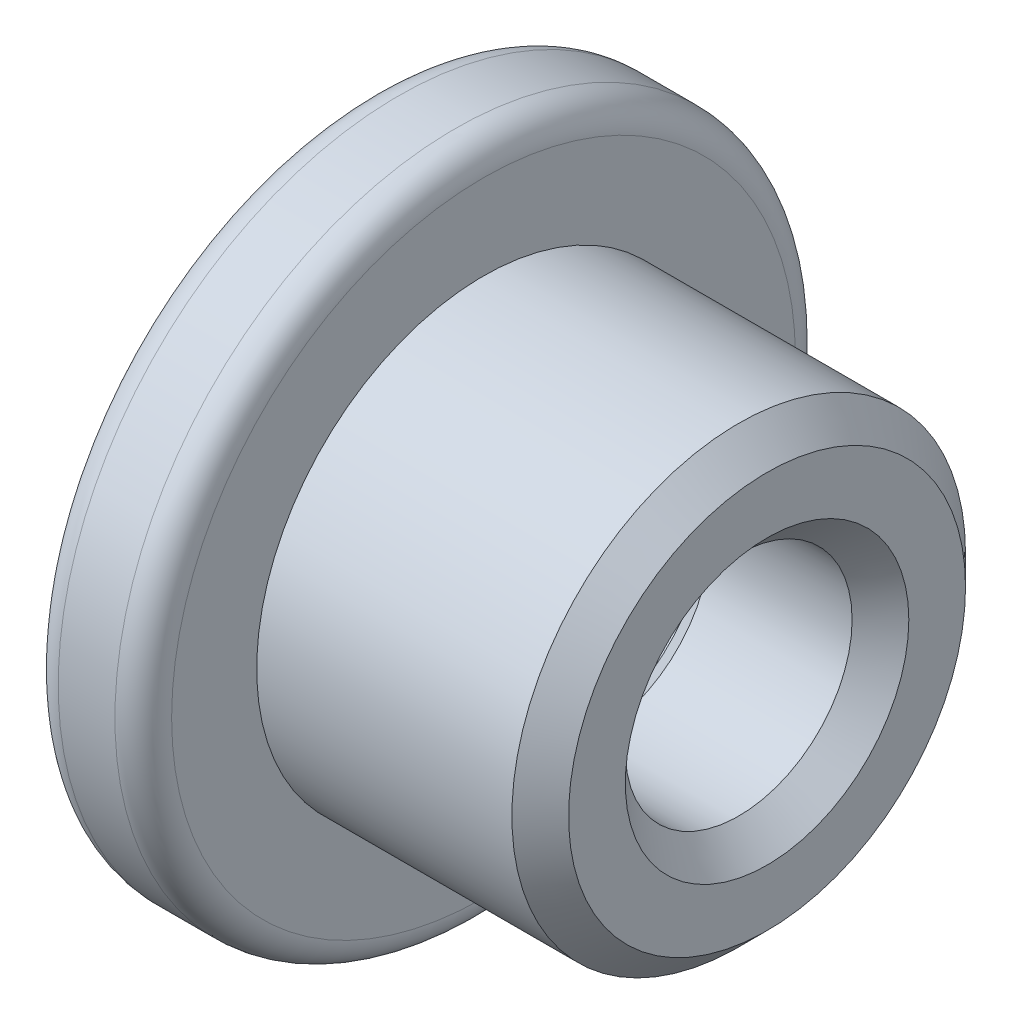
ISO-10303-21;
HEADER;
FILE_DESCRIPTION(('STEP AP214'),'2;1');
FILE_NAME('part.step','',(''),(''),'','','');
FILE_SCHEMA(('AUTOMOTIVE_DESIGN { 1 0 10303 214 1 1 1 1 }'));
ENDSEC;
DATA;
#1=APPLICATION_CONTEXT('core data for automotive mechanical design processes');
#2=APPLICATION_PROTOCOL_DEFINITION('international standard','automotive_design',2000,#1);
#3=PRODUCT_CONTEXT('',#1,'mechanical');
#4=PRODUCT('Part','Part','',(#3));
#5=PRODUCT_RELATED_PRODUCT_CATEGORY('part','',(#4));
#6=PRODUCT_DEFINITION_FORMATION('','',#4);
#7=PRODUCT_DEFINITION_CONTEXT('part definition',#1,'design');
#8=PRODUCT_DEFINITION('design','',#6,#7);
#9=PRODUCT_DEFINITION_SHAPE('','',#8);
#10=(LENGTH_UNIT() NAMED_UNIT(*) SI_UNIT(.MILLI.,.METRE.));
#11=(NAMED_UNIT(*) PLANE_ANGLE_UNIT() SI_UNIT($,.RADIAN.));
#12=(NAMED_UNIT(*) SI_UNIT($,.STERADIAN.) SOLID_ANGLE_UNIT());
#13=UNCERTAINTY_MEASURE_WITH_UNIT(LENGTH_MEASURE(1.E-05),#10,'distance_accuracy_value','');
#14=(GEOMETRIC_REPRESENTATION_CONTEXT(3) GLOBAL_UNCERTAINTY_ASSIGNED_CONTEXT((#13)) GLOBAL_UNIT_ASSIGNED_CONTEXT((#10,
#11,#12)) REPRESENTATION_CONTEXT('',''));
#15=CARTESIAN_POINT('',(0.,0.,0.));
#16=DIRECTION('',(0.,0.,1.));
#17=DIRECTION('',(1.,0.,0.));
#18=AXIS2_PLACEMENT_3D('',#15,#16,#17);
#19=CARTESIAN_POINT('',(1.5,0.,5.));
#20=DIRECTION('',(1.,0.,0.));
#21=DIRECTION('',(0.,0.,-1.));
#22=AXIS2_PLACEMENT_3D('',#19,#20,#21);
#23=PLANE('',#22);
#24=DIRECTION('',(0.,-1.,0.));
#25=VECTOR('',#24,1.);
#26=CARTESIAN_POINT('',(1.5,1.44337567297407,-2.5));
#27=LINE('',#26,#25);
#28=CARTESIAN_POINT('',(1.5,1.44337567297407,-2.5));
#29=VERTEX_POINT('',#28);
#30=CARTESIAN_POINT('',(1.5,0.,-2.5));
#31=VERTEX_POINT('',#30);
#32=EDGE_CURVE('E110',#29,#31,#27,.T.);
#33=ORIENTED_EDGE('',*,*,#32,.T.);
#34=CARTESIAN_POINT('',(1.5,0.,0.));
#35=DIRECTION('',(1.,0.,0.));
#36=DIRECTION('',(0.,0.,-1.));
#37=AXIS2_PLACEMENT_3D('',#34,#35,#36);
#38=CIRCLE('',#37,2.5);
#39=CARTESIAN_POINT('',(1.5,2.1650635094611,-1.25));
#40=VERTEX_POINT('',#39);
#41=EDGE_CURVE('E191',#31,#40,#38,.T.);
#42=ORIENTED_EDGE('',*,*,#41,.T.);
#43=DIRECTION('',(0.,-0.5,-0.866025403784439));
#44=VECTOR('',#43,1.);
#45=CARTESIAN_POINT('',(1.5,2.88675134594813,0.));
#46=LINE('',#45,#44);
#47=EDGE_CURVE('E143',#40,#29,#46,.T.);
#48=ORIENTED_EDGE('',*,*,#47,.T.);
#49=EDGE_LOOP('',(#33,#42,#48));
#50=FACE_BOUND('',#49,.T.);
#51=ADVANCED_FACE('F27',(#50),#23,.F.);
#52=CARTESIAN_POINT('',(1.5,2.88675134594813,0.));
#53=VERTEX_POINT('',#52);
#54=EDGE_CURVE('E144',#53,#40,#46,.T.);
#55=ORIENTED_EDGE('',*,*,#54,.T.);
#56=CARTESIAN_POINT('',(1.5,0.,0.));
#57=DIRECTION('',(1.,0.,0.));
#58=DIRECTION('',(0.,0.,-1.));
#59=AXIS2_PLACEMENT_3D('',#56,#57,#58);
#60=CIRCLE('',#59,2.5);
#61=CARTESIAN_POINT('',(1.5,2.1650635094611,1.25));
#62=VERTEX_POINT('',#61);
#63=EDGE_CURVE('E189',#40,#62,#60,.T.);
#64=ORIENTED_EDGE('',*,*,#63,.T.);
#65=DIRECTION('',(0.,0.5,-0.866025403784439));
#66=VECTOR('',#65,1.);
#67=CARTESIAN_POINT('',(1.5,1.44337567297406,2.5));
#68=LINE('',#67,#66);
#69=EDGE_CURVE('E140',#62,#53,#68,.T.);
#70=ORIENTED_EDGE('',*,*,#69,.T.);
#71=EDGE_LOOP('',(#55,#64,#70));
#72=FACE_BOUND('',#71,.T.);
#73=ADVANCED_FACE('F229',(#72),#23,.F.);
#74=CARTESIAN_POINT('',(1.5,1.44337567297406,2.5));
#75=VERTEX_POINT('',#74);
#76=EDGE_CURVE('E141',#75,#62,#68,.T.);
#77=ORIENTED_EDGE('',*,*,#76,.T.);
#78=CARTESIAN_POINT('',(1.5,0.,0.));
#79=DIRECTION('',(1.,0.,0.));
#80=DIRECTION('',(0.,0.,-1.));
#81=AXIS2_PLACEMENT_3D('',#78,#79,#80);
#82=CIRCLE('',#81,2.5);
#83=CARTESIAN_POINT('',(1.5,0.,2.5));
#84=VERTEX_POINT('',#83);
#85=EDGE_CURVE('E42',#62,#84,#82,.T.);
#86=ORIENTED_EDGE('',*,*,#85,.T.);
#87=DIRECTION('',(0.,1.,0.));
#88=VECTOR('',#87,1.);
#89=CARTESIAN_POINT('',(1.5,-1.44337567297407,2.5));
#90=LINE('',#89,#88);
#91=EDGE_CURVE('E157',#84,#75,#90,.T.);
#92=ORIENTED_EDGE('',*,*,#91,.T.);
#93=EDGE_LOOP('',(#77,#86,#92));
#94=FACE_BOUND('',#93,.T.);
#95=ADVANCED_FACE('F236',(#94),#23,.F.);
#96=CARTESIAN_POINT('',(1.5,-1.44337567297407,2.5));
#97=VERTEX_POINT('',#96);
#98=EDGE_CURVE('E158',#97,#84,#90,.T.);
#99=ORIENTED_EDGE('',*,*,#98,.T.);
#100=CARTESIAN_POINT('',(1.5,0.,0.));
#101=DIRECTION('',(1.,0.,0.));
#102=DIRECTION('',(0.,0.,-1.));
#103=AXIS2_PLACEMENT_3D('',#100,#101,#102);
#104=CIRCLE('',#103,2.5);
#105=CARTESIAN_POINT('',(1.5,-2.1650635094611,1.25));
#106=VERTEX_POINT('',#105);
#107=EDGE_CURVE('E50',#84,#106,#104,.T.);
#108=ORIENTED_EDGE('',*,*,#107,.T.);
#109=DIRECTION('',(0.,0.5,0.866025403784439));
#110=VECTOR('',#109,1.);
#111=CARTESIAN_POINT('',(1.5,-2.88675134594813,0.));
#112=LINE('',#111,#110);
#113=EDGE_CURVE('E153',#106,#97,#112,.T.);
#114=ORIENTED_EDGE('',*,*,#113,.T.);
#115=EDGE_LOOP('',(#99,#108,#114));
#116=FACE_BOUND('',#115,.T.);
#117=ADVANCED_FACE('F253',(#116),#23,.F.);
#118=CARTESIAN_POINT('',(1.5,-2.88675134594813,0.));
#119=VERTEX_POINT('',#118);
#120=EDGE_CURVE('E154',#119,#106,#112,.T.);
#121=ORIENTED_EDGE('',*,*,#120,.T.);
#122=CARTESIAN_POINT('',(1.5,0.,0.));
#123=DIRECTION('',(1.,0.,0.));
#124=DIRECTION('',(0.,0.,-1.));
#125=AXIS2_PLACEMENT_3D('',#122,#123,#124);
#126=CIRCLE('',#125,2.5);
#127=CARTESIAN_POINT('',(1.5,-2.1650635094611,-1.25));
#128=VERTEX_POINT('',#127);
#129=EDGE_CURVE('E185',#106,#128,#126,.T.);
#130=ORIENTED_EDGE('',*,*,#129,.T.);
#131=DIRECTION('',(0.,-0.5,0.866025403784439));
#132=VECTOR('',#131,1.);
#133=CARTESIAN_POINT('',(1.5,-1.44337567297406,-2.5));
#134=LINE('',#133,#132);
#135=EDGE_CURVE('E149',#128,#119,#134,.T.);
#136=ORIENTED_EDGE('',*,*,#135,.T.);
#137=EDGE_LOOP('',(#121,#130,#136));
#138=FACE_BOUND('',#137,.T.);
#139=ADVANCED_FACE('F243',(#138),#23,.F.);
#140=CARTESIAN_POINT('',(5.,0.,0.));
#141=DIRECTION('',(1.,0.,0.));
#142=DIRECTION('',(0.,0.,-1.));
#143=AXIS2_PLACEMENT_3D('',#140,#141,#142);
#144=PLANE('',#143);
#145=CARTESIAN_POINT('',(5.,0.,0.));
#146=DIRECTION('',(1.,0.,0.));
#147=DIRECTION('',(0.,0.,-1.));
#148=AXIS2_PLACEMENT_3D('',#145,#146,#147);
#149=CIRCLE('',#148,2.5);
#150=CARTESIAN_POINT('',(5.,0.,-2.5));
#151=VERTEX_POINT('',#150);
#152=EDGE_CURVE('E180',#151,#151,#149,.F.);
#153=ORIENTED_EDGE('',*,*,#152,.T.);
#154=EDGE_LOOP('',(#153));
#155=FACE_BOUND('',#154,.T.);
#156=CARTESIAN_POINT('',(5.,0.,0.));
#157=DIRECTION('',(1.,0.,0.));
#158=DIRECTION('',(0.,0.,-1.));
#159=AXIS2_PLACEMENT_3D('',#156,#157,#158);
#160=CIRCLE('',#159,3.5);
#161=CARTESIAN_POINT('',(5.,0.,-3.5));
#162=VERTEX_POINT('',#161);
#163=EDGE_CURVE('E177',#162,#162,#160,.T.);
#164=ORIENTED_EDGE('',*,*,#163,.T.);
#165=EDGE_LOOP('',(#164));
#166=FACE_BOUND('',#165,.T.);
#167=ADVANCED_FACE('F252',(#155,#166),#144,.T.);
#168=CARTESIAN_POINT('',(5.,0.,0.));
#169=DIRECTION('',(-1.,0.,0.));
#170=DIRECTION('',(0.,0.,1.));
#171=AXIS2_PLACEMENT_3D('',#168,#169,#170);
#172=CYLINDRICAL_SURFACE('',#171,4.);
#173=CARTESIAN_POINT('',(4.5,0.,0.));
#174=DIRECTION('',(1.,0.,0.));
#175=DIRECTION('',(0.,0.,-1.));
#176=AXIS2_PLACEMENT_3D('',#173,#174,#175);
#177=CIRCLE('',#176,4.);
#178=CARTESIAN_POINT('',(4.5,0.,-4.));
#179=VERTEX_POINT('',#178);
#180=EDGE_CURVE('E194',#179,#179,#177,.F.);
#181=ORIENTED_EDGE('',*,*,#180,.T.);
#182=EDGE_LOOP('',(#181));
#183=FACE_BOUND('',#182,.T.);
#184=CARTESIAN_POINT('',(0.,0.,0.));
#185=DIRECTION('',(1.,0.,0.));
#186=DIRECTION('',(0.,0.,-1.));
#187=AXIS2_PLACEMENT_3D('',#184,#185,#186);
#188=CIRCLE('',#187,4.);
#189=CARTESIAN_POINT('',(0.,0.,-4.));
#190=VERTEX_POINT('',#189);
#191=EDGE_CURVE('E162',#190,#190,#188,.T.);
#192=ORIENTED_EDGE('',*,*,#191,.T.);
#193=EDGE_LOOP('',(#192));
#194=FACE_BOUND('',#193,.T.);
#195=ADVANCED_FACE('F29',(#183,#194),#172,.T.);
#196=CARTESIAN_POINT('',(5.,0.,0.));
#197=DIRECTION('',(-1.,0.,0.));
#198=DIRECTION('',(0.,0.,1.));
#199=AXIS2_PLACEMENT_3D('',#196,#197,#198);
#200=CYLINDRICAL_SURFACE('',#199,2.);
#201=CARTESIAN_POINT('',(4.5,0.,0.));
#202=DIRECTION('',(1.,0.,0.));
#203=DIRECTION('',(0.,0.,-1.));
#204=AXIS2_PLACEMENT_3D('',#201,#202,#203);
#205=CIRCLE('',#204,2.);
#206=CARTESIAN_POINT('',(4.5,0.,-2.));
#207=VERTEX_POINT('',#206);
#208=EDGE_CURVE('E174',#207,#207,#205,.T.);
#209=ORIENTED_EDGE('',*,*,#208,.T.);
#210=EDGE_LOOP('',(#209));
#211=FACE_BOUND('',#210,.T.);
#212=CARTESIAN_POINT('',(2.,0.,0.));
#213=DIRECTION('',(1.,0.,0.));
#214=DIRECTION('',(0.,0.,-1.));
#215=AXIS2_PLACEMENT_3D('',#212,#213,#214);
#216=CIRCLE('',#215,2.);
#217=CARTESIAN_POINT('',(2.,0.,-2.));
#218=VERTEX_POINT('',#217);
#219=EDGE_CURVE('E171',#218,#218,#216,.F.);
#220=ORIENTED_EDGE('',*,*,#219,.T.);
#221=EDGE_LOOP('',(#220));
#222=FACE_BOUND('',#221,.T.);
#223=ADVANCED_FACE('F217',(#211,#222),#200,.F.);
#224=CARTESIAN_POINT('',(-2.,0.,0.));
#225=DIRECTION('',(1.,0.,0.));
#226=DIRECTION('',(0.,0.,-1.));
#227=AXIS2_PLACEMENT_3D('',#224,#225,#226);
#228=PLANE('',#227);
#229=CARTESIAN_POINT('',(-2.,0.,0.));
#230=DIRECTION('',(1.,0.,0.));
#231=DIRECTION('',(0.,0.,-1.));
#232=AXIS2_PLACEMENT_3D('',#229,#230,#231);
#233=CIRCLE('',#232,5.5);
#234=CARTESIAN_POINT('',(-2.,0.,-5.5));
#235=VERTEX_POINT('',#234);
#236=EDGE_CURVE('E197',#235,#235,#233,.F.);
#237=ORIENTED_EDGE('',*,*,#236,.T.);
#238=EDGE_LOOP('',(#237));
#239=FACE_BOUND('',#238,.T.);
#240=DIRECTION('',(0.,-0.5,-0.866025403784439));
#241=VECTOR('',#240,1.);
#242=CARTESIAN_POINT('',(-2.,2.88675134594813,0.));
#243=LINE('',#242,#241);
#244=CARTESIAN_POINT('',(-2.,2.88675134594813,0.));
#245=VERTEX_POINT('',#244);
#246=CARTESIAN_POINT('',(-2.,1.44337567297407,-2.5));
#247=VERTEX_POINT('',#246);
#248=EDGE_CURVE('E118',#245,#247,#243,.T.);
#249=ORIENTED_EDGE('',*,*,#248,.F.);
#250=DIRECTION('',(0.,0.5,-0.866025403784439));
#251=VECTOR('',#250,1.);
#252=CARTESIAN_POINT('',(-2.,1.44337567297406,2.5));
#253=LINE('',#252,#251);
#254=CARTESIAN_POINT('',(-2.,1.44337567297406,2.5));
#255=VERTEX_POINT('',#254);
#256=EDGE_CURVE('E124',#255,#245,#253,.T.);
#257=ORIENTED_EDGE('',*,*,#256,.F.);
#258=DIRECTION('',(0.,1.,0.));
#259=VECTOR('',#258,1.);
#260=CARTESIAN_POINT('',(-2.,-1.44337567297407,2.5));
#261=LINE('',#260,#259);
#262=CARTESIAN_POINT('',(-2.,-1.44337567297407,2.5));
#263=VERTEX_POINT('',#262);
#264=EDGE_CURVE('E137',#263,#255,#261,.T.);
#265=ORIENTED_EDGE('',*,*,#264,.F.);
#266=DIRECTION('',(0.,0.5,0.866025403784439));
#267=VECTOR('',#266,1.);
#268=CARTESIAN_POINT('',(-2.,-2.88675134594813,0.));
#269=LINE('',#268,#267);
#270=CARTESIAN_POINT('',(-2.,-2.88675134594813,0.));
#271=VERTEX_POINT('',#270);
#272=EDGE_CURVE('E131',#271,#263,#269,.T.);
#273=ORIENTED_EDGE('',*,*,#272,.F.);
#274=DIRECTION('',(0.,-0.5,0.866025403784439));
#275=VECTOR('',#274,1.);
#276=CARTESIAN_POINT('',(-2.,-1.44337567297406,-2.5));
#277=LINE('',#276,#275);
#278=CARTESIAN_POINT('',(-2.,-1.44337567297406,-2.5));
#279=VERTEX_POINT('',#278);
#280=EDGE_CURVE('E129',#279,#271,#277,.T.);
#281=ORIENTED_EDGE('',*,*,#280,.F.);
#282=DIRECTION('',(0.,-1.,0.));
#283=VECTOR('',#282,1.);
#284=CARTESIAN_POINT('',(-2.,1.44337567297407,-2.5));
#285=LINE('',#284,#283);
#286=EDGE_CURVE('E106',#247,#279,#285,.T.);
#287=ORIENTED_EDGE('',*,*,#286,.F.);
#288=EDGE_LOOP('',(#249,#257,#265,#273,#281,#287));
#289=FACE_BOUND('',#288,.T.);
#290=ADVANCED_FACE('F126',(#239,#289),#228,.F.);
#291=CARTESIAN_POINT('',(-18.9705627484771,0.,0.));
#292=DIRECTION('',(1.,0.,0.));
#293=DIRECTION('',(0.,0.,-1.));
#294=AXIS2_PLACEMENT_3D('',#291,#292,#293);
#295=CYLINDRICAL_SURFACE('',#294,6.);
#296=CARTESIAN_POINT('',(-1.5,0.,0.));
#297=DIRECTION('',(1.,0.,0.));
#298=DIRECTION('',(0.,0.,-1.));
#299=AXIS2_PLACEMENT_3D('',#296,#297,#298);
#300=CIRCLE('',#299,6.);
#301=CARTESIAN_POINT('',(-1.5,0.,-6.));
#302=VERTEX_POINT('',#301);
#303=EDGE_CURVE('E35',#302,#302,#300,.T.);
#304=ORIENTED_EDGE('',*,*,#303,.T.);
#305=EDGE_LOOP('',(#304));
#306=FACE_BOUND('',#305,.T.);
#307=CARTESIAN_POINT('',(-0.5,0.,0.));
#308=DIRECTION('',(1.,0.,0.));
#309=DIRECTION('',(0.,0.,-1.));
#310=AXIS2_PLACEMENT_3D('',#307,#308,#309);
#311=CIRCLE('',#310,6.);
#312=CARTESIAN_POINT('',(-0.5,0.,-6.));
#313=VERTEX_POINT('',#312);
#314=EDGE_CURVE('E200',#313,#313,#311,.F.);
#315=ORIENTED_EDGE('',*,*,#314,.T.);
#316=EDGE_LOOP('',(#315));
#317=FACE_BOUND('',#316,.T.);
#318=ADVANCED_FACE('F205',(#306,#317),#295,.T.);
#319=CARTESIAN_POINT('',(0.,0.,0.));
#320=DIRECTION('',(1.,0.,0.));
#321=DIRECTION('',(0.,0.,-1.));
#322=AXIS2_PLACEMENT_3D('',#319,#320,#321);
#323=PLANE('',#322);
#324=CARTESIAN_POINT('',(0.,0.,0.));
#325=DIRECTION('',(1.,0.,0.));
#326=DIRECTION('',(0.,0.,-1.));
#327=AXIS2_PLACEMENT_3D('',#324,#325,#326);
#328=CIRCLE('',#327,5.5);
#329=CARTESIAN_POINT('',(0.,0.,-5.5));
#330=VERTEX_POINT('',#329);
#331=EDGE_CURVE('E11',#330,#330,#328,.T.);
#332=ORIENTED_EDGE('',*,*,#331,.T.);
#333=EDGE_LOOP('',(#332));
#334=FACE_BOUND('',#333,.T.);
#335=ORIENTED_EDGE('',*,*,#191,.F.);
#336=EDGE_LOOP('',(#335));
#337=FACE_BOUND('',#336,.T.);
#338=ADVANCED_FACE('F223',(#334,#337),#323,.T.);
#339=CARTESIAN_POINT('',(1.5,1.44337567297406,2.5));
#340=DIRECTION('',(0.,0.866025403784439,0.5));
#341=DIRECTION('',(0.,-0.5,0.866025403784439));
#342=AXIS2_PLACEMENT_3D('',#339,#340,#341);
#343=PLANE('',#342);
#344=ORIENTED_EDGE('',*,*,#256,.T.);
#345=DIRECTION('',(-1.,0.,0.));
#346=VECTOR('',#345,1.);
#347=CARTESIAN_POINT('',(1.5,2.88675134594813,0.));
#348=LINE('',#347,#346);
#349=EDGE_CURVE('E114',#53,#245,#348,.T.);
#350=ORIENTED_EDGE('',*,*,#349,.F.);
#351=ORIENTED_EDGE('',*,*,#69,.F.);
#352=ORIENTED_EDGE('',*,*,#76,.F.);
#353=DIRECTION('',(-1.,0.,0.));
#354=VECTOR('',#353,1.);
#355=CARTESIAN_POINT('',(1.5,1.44337567297406,2.5));
#356=LINE('',#355,#354);
#357=EDGE_CURVE('E160',#75,#255,#356,.T.);
#358=ORIENTED_EDGE('',*,*,#357,.T.);
#359=EDGE_LOOP('',(#344,#350,#351,#352,#358));
#360=FACE_BOUND('',#359,.T.);
#361=ADVANCED_FACE('F272',(#360),#343,.F.);
#362=CARTESIAN_POINT('',(1.5,-1.44337567297407,2.5));
#363=DIRECTION('',(0.,0.,1.));
#364=DIRECTION('',(1.,0.,0.));
#365=AXIS2_PLACEMENT_3D('',#362,#363,#364);
#366=PLANE('',#365);
#367=ORIENTED_EDGE('',*,*,#264,.T.);
#368=ORIENTED_EDGE('',*,*,#357,.F.);
#369=ORIENTED_EDGE('',*,*,#91,.F.);
#370=ORIENTED_EDGE('',*,*,#98,.F.);
#371=DIRECTION('',(-1.,0.,0.));
#372=VECTOR('',#371,1.);
#373=CARTESIAN_POINT('',(1.5,-1.44337567297407,2.5));
#374=LINE('',#373,#372);
#375=EDGE_CURVE('E163',#97,#263,#374,.T.);
#376=ORIENTED_EDGE('',*,*,#375,.T.);
#377=EDGE_LOOP('',(#367,#368,#369,#370,#376));
#378=FACE_BOUND('',#377,.T.);
#379=ADVANCED_FACE('F276',(#378),#366,.F.);
#380=CARTESIAN_POINT('',(1.5,-2.88675134594813,0.));
#381=DIRECTION('',(0.,-0.866025403784439,0.5));
#382=DIRECTION('',(0.,-0.5,-0.866025403784439));
#383=AXIS2_PLACEMENT_3D('',#380,#381,#382);
#384=PLANE('',#383);
#385=ORIENTED_EDGE('',*,*,#272,.T.);
#386=ORIENTED_EDGE('',*,*,#375,.F.);
#387=ORIENTED_EDGE('',*,*,#113,.F.);
#388=ORIENTED_EDGE('',*,*,#120,.F.);
#389=DIRECTION('',(-1.,0.,0.));
#390=VECTOR('',#389,1.);
#391=CARTESIAN_POINT('',(1.5,-2.88675134594813,0.));
#392=LINE('',#391,#390);
#393=EDGE_CURVE('E165',#119,#271,#392,.T.);
#394=ORIENTED_EDGE('',*,*,#393,.T.);
#395=EDGE_LOOP('',(#385,#386,#387,#388,#394));
#396=FACE_BOUND('',#395,.T.);
#397=ADVANCED_FACE('F279',(#396),#384,.F.);
#398=CARTESIAN_POINT('',(1.5,-1.44337567297406,-2.5));
#399=DIRECTION('',(0.,-0.866025403784439,-0.5));
#400=DIRECTION('',(0.,0.5,-0.866025403784439));
#401=AXIS2_PLACEMENT_3D('',#398,#399,#400);
#402=PLANE('',#401);
#403=ORIENTED_EDGE('',*,*,#280,.T.);
#404=ORIENTED_EDGE('',*,*,#393,.F.);
#405=ORIENTED_EDGE('',*,*,#135,.F.);
#406=CARTESIAN_POINT('',(1.5,-1.44337567297406,-2.5));
#407=VERTEX_POINT('',#406);
#408=EDGE_CURVE('E150',#407,#128,#134,.T.);
#409=ORIENTED_EDGE('',*,*,#408,.F.);
#410=DIRECTION('',(-1.,0.,0.));
#411=VECTOR('',#410,1.);
#412=CARTESIAN_POINT('',(1.5,-1.44337567297406,-2.5));
#413=LINE('',#412,#411);
#414=EDGE_CURVE('E113',#407,#279,#413,.T.);
#415=ORIENTED_EDGE('',*,*,#414,.T.);
#416=EDGE_LOOP('',(#403,#404,#405,#409,#415));
#417=FACE_BOUND('',#416,.T.);
#418=ADVANCED_FACE('F281',(#417),#402,.F.);
#419=CARTESIAN_POINT('',(1.5,1.44337567297407,-2.5));
#420=DIRECTION('',(0.,0.,-1.));
#421=DIRECTION('',(0.,1.,0.));
#422=AXIS2_PLACEMENT_3D('',#419,#420,#421);
#423=PLANE('',#422);
#424=ORIENTED_EDGE('',*,*,#286,.T.);
#425=ORIENTED_EDGE('',*,*,#414,.F.);
#426=EDGE_CURVE('E147',#31,#407,#27,.T.);
#427=ORIENTED_EDGE('',*,*,#426,.F.);
#428=ORIENTED_EDGE('',*,*,#32,.F.);
#429=DIRECTION('',(-1.,0.,0.));
#430=VECTOR('',#429,1.);
#431=CARTESIAN_POINT('',(1.5,1.44337567297407,-2.5));
#432=LINE('',#431,#430);
#433=EDGE_CURVE('E101',#29,#247,#432,.T.);
#434=ORIENTED_EDGE('',*,*,#433,.T.);
#435=EDGE_LOOP('',(#424,#425,#427,#428,#434));
#436=FACE_BOUND('',#435,.T.);
#437=ADVANCED_FACE('F103',(#436),#423,.F.);
#438=CARTESIAN_POINT('',(1.5,2.88675134594813,0.));
#439=DIRECTION('',(0.,0.866025403784439,-0.5));
#440=DIRECTION('',(0.,0.5,0.866025403784439));
#441=AXIS2_PLACEMENT_3D('',#438,#439,#440);
#442=PLANE('',#441);
#443=ORIENTED_EDGE('',*,*,#248,.T.);
#444=ORIENTED_EDGE('',*,*,#433,.F.);
#445=ORIENTED_EDGE('',*,*,#47,.F.);
#446=ORIENTED_EDGE('',*,*,#54,.F.);
#447=ORIENTED_EDGE('',*,*,#349,.T.);
#448=EDGE_LOOP('',(#443,#444,#445,#446,#447));
#449=FACE_BOUND('',#448,.T.);
#450=ADVANCED_FACE('F119',(#449),#442,.F.);
#451=ORIENTED_EDGE('',*,*,#408,.T.);
#452=CARTESIAN_POINT('',(1.5,0.,0.));
#453=DIRECTION('',(1.,0.,0.));
#454=DIRECTION('',(0.,0.,-1.));
#455=AXIS2_PLACEMENT_3D('',#452,#453,#454);
#456=CIRCLE('',#455,2.5);
#457=EDGE_CURVE('E183',#128,#31,#456,.T.);
#458=ORIENTED_EDGE('',*,*,#457,.T.);
#459=ORIENTED_EDGE('',*,*,#426,.T.);
#460=EDGE_LOOP('',(#451,#458,#459));
#461=FACE_BOUND('',#460,.T.);
#462=ADVANCED_FACE('F232',(#461),#23,.F.);
#463=CARTESIAN_POINT('',(4.5,0.,0.));
#464=DIRECTION('',(1.,0.,0.));
#465=DIRECTION('',(0.,0.,-1.));
#466=AXIS2_PLACEMENT_3D('',#463,#464,#465);
#467=CONICAL_SURFACE('',#466,2.,0.78539816339745);
#468=ORIENTED_EDGE('',*,*,#152,.F.);
#469=EDGE_LOOP('',(#468));
#470=FACE_BOUND('',#469,.T.);
#471=ORIENTED_EDGE('',*,*,#208,.F.);
#472=EDGE_LOOP('',(#471));
#473=FACE_BOUND('',#472,.T.);
#474=ADVANCED_FACE('F241',(#470,#473),#467,.F.);
#475=CARTESIAN_POINT('',(1.5,0.,0.));
#476=DIRECTION('',(-1.,0.,0.));
#477=DIRECTION('',(0.,0.,1.));
#478=AXIS2_PLACEMENT_3D('',#475,#476,#477);
#479=CONICAL_SURFACE('',#478,2.5,0.785398163397448);
#480=ORIENTED_EDGE('',*,*,#219,.F.);
#481=EDGE_LOOP('',(#480));
#482=FACE_BOUND('',#481,.T.);
#483=ORIENTED_EDGE('',*,*,#63,.F.);
#484=ORIENTED_EDGE('',*,*,#41,.F.);
#485=ORIENTED_EDGE('',*,*,#457,.F.);
#486=ORIENTED_EDGE('',*,*,#129,.F.);
#487=ORIENTED_EDGE('',*,*,#107,.F.);
#488=ORIENTED_EDGE('',*,*,#85,.F.);
#489=EDGE_LOOP('',(#483,#484,#485,#486,#487,#488));
#490=FACE_BOUND('',#489,.T.);
#491=ADVANCED_FACE('F248',(#482,#490),#479,.F.);
#492=CARTESIAN_POINT('',(5.,0.,0.));
#493=DIRECTION('',(-1.,0.,0.));
#494=DIRECTION('',(0.,0.,1.));
#495=AXIS2_PLACEMENT_3D('',#492,#493,#494);
#496=CONICAL_SURFACE('',#495,3.5,0.785398163397447);
#497=ORIENTED_EDGE('',*,*,#180,.F.);
#498=EDGE_LOOP('',(#497));
#499=FACE_BOUND('',#498,.T.);
#500=ORIENTED_EDGE('',*,*,#163,.F.);
#501=EDGE_LOOP('',(#500));
#502=FACE_BOUND('',#501,.T.);
#503=ADVANCED_FACE('F212',(#499,#502),#496,.T.);
#504=CARTESIAN_POINT('',(-1.5,0.,0.));
#505=DIRECTION('',(1.,0.,0.));
#506=DIRECTION('',(0.,0.,-1.));
#507=AXIS2_PLACEMENT_3D('',#504,#505,#506);
#508=TOROIDAL_SURFACE('',#507,5.5,0.5);
#509=ORIENTED_EDGE('',*,*,#303,.F.);
#510=EDGE_LOOP('',(#509));
#511=FACE_BOUND('',#510,.T.);
#512=ORIENTED_EDGE('',*,*,#236,.F.);
#513=EDGE_LOOP('',(#512));
#514=FACE_BOUND('',#513,.T.);
#515=ADVANCED_FACE('F208',(#511,#514),#508,.T.);
#516=CARTESIAN_POINT('',(-0.5,0.,0.));
#517=DIRECTION('',(1.,0.,0.));
#518=DIRECTION('',(0.,0.,-1.));
#519=AXIS2_PLACEMENT_3D('',#516,#517,#518);
#520=TOROIDAL_SURFACE('',#519,5.5,0.5);
#521=ORIENTED_EDGE('',*,*,#314,.F.);
#522=EDGE_LOOP('',(#521));
#523=FACE_BOUND('',#522,.T.);
#524=ORIENTED_EDGE('',*,*,#331,.F.);
#525=EDGE_LOOP('',(#524));
#526=FACE_BOUND('',#525,.T.);
#527=ADVANCED_FACE('F211',(#523,#526),#520,.T.);
#528=CLOSED_SHELL('',(#51,#73,#95,#117,#139,#167,#195,#223,#290,#318,#338,#361,#379,#397,#418,
#437,#450,#462,#474,#491,#503,#515,#527));
#529=MANIFOLD_SOLID_BREP('B2',#528);
#530=ADVANCED_BREP_SHAPE_REPRESENTATION('',(#18,#529),#14);
#531=SHAPE_DEFINITION_REPRESENTATION(#9,#530);
ENDSEC;
END-ISO-10303-21;
